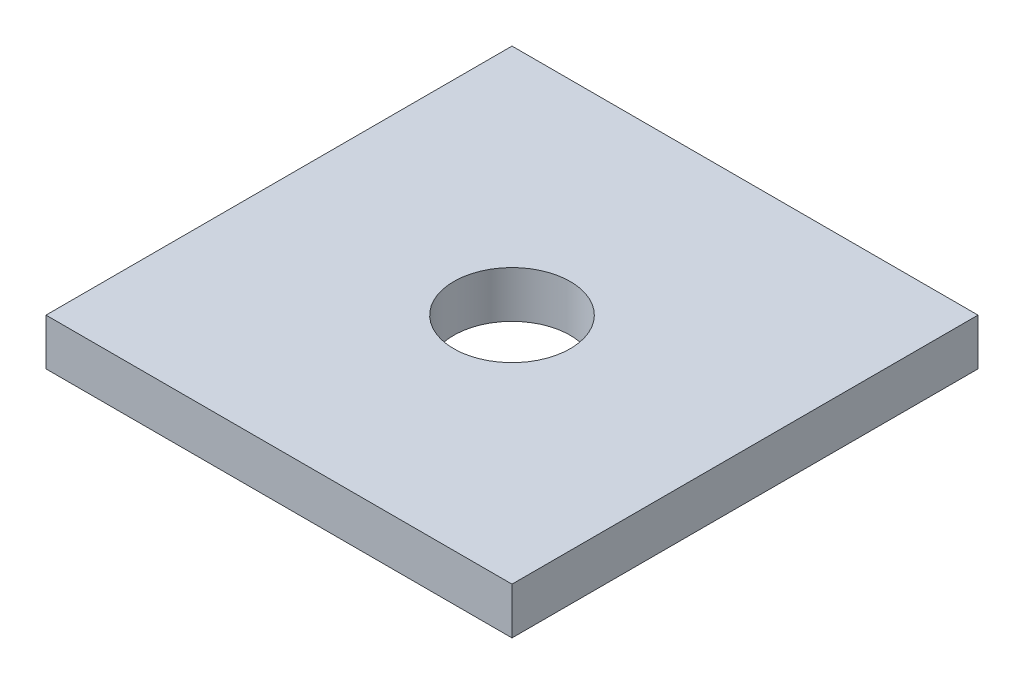
ISO-10303-21;
HEADER;
FILE_DESCRIPTION(('STEP AP214'),'2;1');
FILE_NAME('part.step','',(''),(''),'','','');
FILE_SCHEMA(('AUTOMOTIVE_DESIGN { 1 0 10303 214 1 1 1 1 }'));
ENDSEC;
DATA;
#1=APPLICATION_CONTEXT('core data for automotive mechanical design processes');
#2=APPLICATION_PROTOCOL_DEFINITION('international standard','automotive_design',2000,#1);
#3=PRODUCT_CONTEXT('',#1,'mechanical');
#4=PRODUCT('Part','Part','',(#3));
#5=PRODUCT_RELATED_PRODUCT_CATEGORY('part','',(#4));
#6=PRODUCT_DEFINITION_FORMATION('','',#4);
#7=PRODUCT_DEFINITION_CONTEXT('part definition',#1,'design');
#8=PRODUCT_DEFINITION('design','',#6,#7);
#9=PRODUCT_DEFINITION_SHAPE('','',#8);
#10=(LENGTH_UNIT() NAMED_UNIT(*) SI_UNIT(.MILLI.,.METRE.));
#11=(NAMED_UNIT(*) PLANE_ANGLE_UNIT() SI_UNIT($,.RADIAN.));
#12=(NAMED_UNIT(*) SI_UNIT($,.STERADIAN.) SOLID_ANGLE_UNIT());
#13=UNCERTAINTY_MEASURE_WITH_UNIT(LENGTH_MEASURE(1.E-05),#10,'distance_accuracy_value','');
#14=(GEOMETRIC_REPRESENTATION_CONTEXT(3) GLOBAL_UNCERTAINTY_ASSIGNED_CONTEXT((#13)) GLOBAL_UNIT_ASSIGNED_CONTEXT((#10,
#11,#12)) REPRESENTATION_CONTEXT('',''));
#15=CARTESIAN_POINT('',(0.,0.,0.));
#16=DIRECTION('',(0.,0.,1.));
#17=DIRECTION('',(1.,0.,0.));
#18=AXIS2_PLACEMENT_3D('',#15,#16,#17);
#19=CARTESIAN_POINT('',(0.,2.54,0.));
#20=DIRECTION('',(1.,0.,0.));
#21=DIRECTION('',(0.,0.,-1.));
#22=AXIS2_PLACEMENT_3D('',#19,#20,#21);
#23=PLANE('',#22);
#24=DIRECTION('',(0.,0.,1.));
#25=VECTOR('',#24,1.);
#26=CARTESIAN_POINT('',(0.,0.,0.));
#27=LINE('',#26,#25);
#28=CARTESIAN_POINT('',(0.,0.,-25.4));
#29=VERTEX_POINT('',#28);
#30=CARTESIAN_POINT('',(0.,0.,0.));
#31=VERTEX_POINT('',#30);
#32=EDGE_CURVE('E107',#29,#31,#27,.T.);
#33=ORIENTED_EDGE('',*,*,#32,.T.);
#34=DIRECTION('',(0.,-1.,0.));
#35=VECTOR('',#34,1.);
#36=CARTESIAN_POINT('',(0.,2.54,0.));
#37=LINE('',#36,#35);
#38=CARTESIAN_POINT('',(0.,2.54,0.));
#39=VERTEX_POINT('',#38);
#40=EDGE_CURVE('E11',#39,#31,#37,.T.);
#41=ORIENTED_EDGE('',*,*,#40,.F.);
#42=DIRECTION('',(0.,0.,1.));
#43=VECTOR('',#42,1.);
#44=CARTESIAN_POINT('',(0.,2.54,0.));
#45=LINE('',#44,#43);
#46=CARTESIAN_POINT('',(0.,2.54,-25.4));
#47=VERTEX_POINT('',#46);
#48=EDGE_CURVE('E91',#47,#39,#45,.T.);
#49=ORIENTED_EDGE('',*,*,#48,.F.);
#50=DIRECTION('',(0.,-1.,0.));
#51=VECTOR('',#50,1.);
#52=CARTESIAN_POINT('',(0.,2.54,-25.4));
#53=LINE('',#52,#51);
#54=EDGE_CURVE('E103',#47,#29,#53,.T.);
#55=ORIENTED_EDGE('',*,*,#54,.T.);
#56=EDGE_LOOP('',(#33,#41,#49,#55));
#57=FACE_BOUND('',#56,.T.);
#58=ADVANCED_FACE('F39',(#57),#23,.F.);
#59=CARTESIAN_POINT('',(0.,2.54,0.));
#60=DIRECTION('',(0.,0.,-1.));
#61=DIRECTION('',(-1.,0.,0.));
#62=AXIS2_PLACEMENT_3D('',#59,#60,#61);
#63=PLANE('',#62);
#64=DIRECTION('',(1.,0.,0.));
#65=VECTOR('',#64,1.);
#66=CARTESIAN_POINT('',(0.,0.,0.));
#67=LINE('',#66,#65);
#68=CARTESIAN_POINT('',(25.4,0.,0.));
#69=VERTEX_POINT('',#68);
#70=EDGE_CURVE('E96',#31,#69,#67,.T.);
#71=ORIENTED_EDGE('',*,*,#70,.T.);
#72=DIRECTION('',(0.,-1.,0.));
#73=VECTOR('',#72,1.);
#74=CARTESIAN_POINT('',(25.4,2.54,0.));
#75=LINE('',#74,#73);
#76=CARTESIAN_POINT('',(25.4,2.54,0.));
#77=VERTEX_POINT('',#76);
#78=EDGE_CURVE('E48',#77,#69,#75,.T.);
#79=ORIENTED_EDGE('',*,*,#78,.F.);
#80=DIRECTION('',(1.,0.,0.));
#81=VECTOR('',#80,1.);
#82=CARTESIAN_POINT('',(0.,2.54,0.));
#83=LINE('',#82,#81);
#84=EDGE_CURVE('E86',#39,#77,#83,.T.);
#85=ORIENTED_EDGE('',*,*,#84,.F.);
#86=ORIENTED_EDGE('',*,*,#40,.T.);
#87=EDGE_LOOP('',(#71,#79,#85,#86));
#88=FACE_BOUND('',#87,.T.);
#89=ADVANCED_FACE('F95',(#88),#63,.F.);
#90=CARTESIAN_POINT('',(25.4,2.54,0.));
#91=DIRECTION('',(-1.,0.,0.));
#92=DIRECTION('',(0.,0.,1.));
#93=AXIS2_PLACEMENT_3D('',#90,#91,#92);
#94=PLANE('',#93);
#95=DIRECTION('',(0.,0.,-1.));
#96=VECTOR('',#95,1.);
#97=CARTESIAN_POINT('',(25.4,0.,0.));
#98=LINE('',#97,#96);
#99=CARTESIAN_POINT('',(25.4,0.,-25.4));
#100=VERTEX_POINT('',#99);
#101=EDGE_CURVE('E73',#69,#100,#98,.T.);
#102=ORIENTED_EDGE('',*,*,#101,.T.);
#103=DIRECTION('',(0.,-1.,0.));
#104=VECTOR('',#103,1.);
#105=CARTESIAN_POINT('',(25.4,2.54,-25.4));
#106=LINE('',#105,#104);
#107=CARTESIAN_POINT('',(25.4,2.54,-25.4));
#108=VERTEX_POINT('',#107);
#109=EDGE_CURVE('E98',#108,#100,#106,.T.);
#110=ORIENTED_EDGE('',*,*,#109,.F.);
#111=DIRECTION('',(0.,0.,-1.));
#112=VECTOR('',#111,1.);
#113=CARTESIAN_POINT('',(25.4,2.54,0.));
#114=LINE('',#113,#112);
#115=EDGE_CURVE('E89',#77,#108,#114,.T.);
#116=ORIENTED_EDGE('',*,*,#115,.F.);
#117=ORIENTED_EDGE('',*,*,#78,.T.);
#118=EDGE_LOOP('',(#102,#110,#116,#117));
#119=FACE_BOUND('',#118,.T.);
#120=ADVANCED_FACE('F99',(#119),#94,.F.);
#121=CARTESIAN_POINT('',(0.,2.54,-25.4));
#122=DIRECTION('',(0.,0.,1.));
#123=DIRECTION('',(1.,0.,0.));
#124=AXIS2_PLACEMENT_3D('',#121,#122,#123);
#125=PLANE('',#124);
#126=DIRECTION('',(-1.,0.,0.));
#127=VECTOR('',#126,1.);
#128=CARTESIAN_POINT('',(0.,0.,-25.4));
#129=LINE('',#128,#127);
#130=EDGE_CURVE('E79',#100,#29,#129,.T.);
#131=ORIENTED_EDGE('',*,*,#130,.T.);
#132=ORIENTED_EDGE('',*,*,#54,.F.);
#133=DIRECTION('',(-1.,0.,0.));
#134=VECTOR('',#133,1.);
#135=CARTESIAN_POINT('',(0.,2.54,-25.4));
#136=LINE('',#135,#134);
#137=EDGE_CURVE('E56',#108,#47,#136,.T.);
#138=ORIENTED_EDGE('',*,*,#137,.F.);
#139=ORIENTED_EDGE('',*,*,#109,.T.);
#140=EDGE_LOOP('',(#131,#132,#138,#139));
#141=FACE_BOUND('',#140,.T.);
#142=ADVANCED_FACE('F121',(#141),#125,.F.);
#143=CARTESIAN_POINT('',(0.,2.54,0.));
#144=DIRECTION('',(0.,-1.,0.));
#145=DIRECTION('',(0.,0.,-1.));
#146=AXIS2_PLACEMENT_3D('',#143,#144,#145);
#147=PLANE('',#146);
#148=CARTESIAN_POINT('',(12.7,2.54,-12.7));
#149=DIRECTION('',(0.,1.,0.));
#150=DIRECTION('',(0.,0.,1.));
#151=AXIS2_PLACEMENT_3D('',#148,#149,#150);
#152=CIRCLE('',#151,3.175);
#153=CARTESIAN_POINT('',(12.7,2.54,-9.525));
#154=VERTEX_POINT('',#153);
#155=EDGE_CURVE('E128',#154,#154,#152,.T.);
#156=ORIENTED_EDGE('',*,*,#155,.F.);
#157=EDGE_LOOP('',(#156));
#158=FACE_BOUND('',#157,.T.);
#159=ORIENTED_EDGE('',*,*,#48,.T.);
#160=ORIENTED_EDGE('',*,*,#84,.T.);
#161=ORIENTED_EDGE('',*,*,#115,.T.);
#162=ORIENTED_EDGE('',*,*,#137,.T.);
#163=EDGE_LOOP('',(#159,#160,#161,#162));
#164=FACE_BOUND('',#163,.T.);
#165=ADVANCED_FACE('F87',(#158,#164),#147,.F.);
#166=CARTESIAN_POINT('',(0.,0.,0.));
#167=DIRECTION('',(0.,-1.,0.));
#168=DIRECTION('',(0.,0.,-1.));
#169=AXIS2_PLACEMENT_3D('',#166,#167,#168);
#170=PLANE('',#169);
#171=CARTESIAN_POINT('',(12.7,0.,-12.7));
#172=DIRECTION('',(0.,1.,0.));
#173=DIRECTION('',(0.,0.,1.));
#174=AXIS2_PLACEMENT_3D('',#171,#172,#173);
#175=CIRCLE('',#174,3.175);
#176=CARTESIAN_POINT('',(12.7,0.,-9.525));
#177=VERTEX_POINT('',#176);
#178=EDGE_CURVE('E111',#177,#177,#175,.T.);
#179=ORIENTED_EDGE('',*,*,#178,.T.);
#180=EDGE_LOOP('',(#179));
#181=FACE_BOUND('',#180,.T.);
#182=ORIENTED_EDGE('',*,*,#32,.F.);
#183=ORIENTED_EDGE('',*,*,#130,.F.);
#184=ORIENTED_EDGE('',*,*,#101,.F.);
#185=ORIENTED_EDGE('',*,*,#70,.F.);
#186=EDGE_LOOP('',(#182,#183,#184,#185));
#187=FACE_BOUND('',#186,.T.);
#188=ADVANCED_FACE('F124',(#181,#187),#170,.T.);
#189=CARTESIAN_POINT('',(12.7,0.,-12.7));
#190=DIRECTION('',(0.,1.,0.));
#191=DIRECTION('',(0.,0.,1.));
#192=AXIS2_PLACEMENT_3D('',#189,#190,#191);
#193=CYLINDRICAL_SURFACE('',#192,3.175);
#194=ORIENTED_EDGE('',*,*,#178,.F.);
#195=EDGE_LOOP('',(#194));
#196=FACE_BOUND('',#195,.T.);
#197=ORIENTED_EDGE('',*,*,#155,.T.);
#198=EDGE_LOOP('',(#197));
#199=FACE_BOUND('',#198,.T.);
#200=ADVANCED_FACE('F137',(#196,#199),#193,.F.);
#201=CLOSED_SHELL('',(#58,#89,#120,#142,#165,#188,#200));
#202=MANIFOLD_SOLID_BREP('B2',#201);
#203=ADVANCED_BREP_SHAPE_REPRESENTATION('',(#18,#202),#14);
#204=SHAPE_DEFINITION_REPRESENTATION(#9,#203);
ENDSEC;
END-ISO-10303-21;
